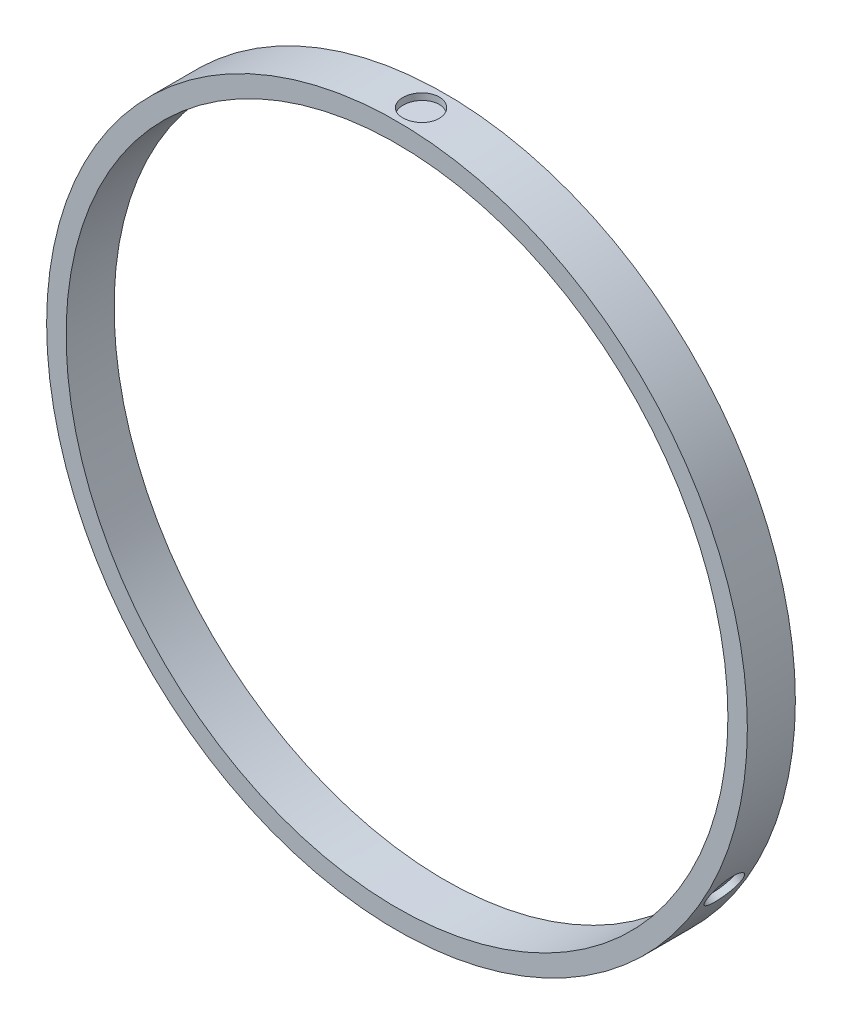
ISO-10303-21;
HEADER;
FILE_DESCRIPTION(('STEP AP214'),'2;1');
FILE_NAME('part.step','',(''),(''),'','','');
FILE_SCHEMA(('AUTOMOTIVE_DESIGN { 1 0 10303 214 1 1 1 1 }'));
ENDSEC;
DATA;
#1=APPLICATION_CONTEXT('core data for automotive mechanical design processes');
#2=APPLICATION_PROTOCOL_DEFINITION('international standard','automotive_design',2000,#1);
#3=PRODUCT_CONTEXT('',#1,'mechanical');
#4=PRODUCT('Part','Part','',(#3));
#5=PRODUCT_RELATED_PRODUCT_CATEGORY('part','',(#4));
#6=PRODUCT_DEFINITION_FORMATION('','',#4);
#7=PRODUCT_DEFINITION_CONTEXT('part definition',#1,'design');
#8=PRODUCT_DEFINITION('design','',#6,#7);
#9=PRODUCT_DEFINITION_SHAPE('','',#8);
#10=(LENGTH_UNIT() NAMED_UNIT(*) SI_UNIT(.MILLI.,.METRE.));
#11=(NAMED_UNIT(*) PLANE_ANGLE_UNIT() SI_UNIT($,.RADIAN.));
#12=(NAMED_UNIT(*) SI_UNIT($,.STERADIAN.) SOLID_ANGLE_UNIT());
#13=UNCERTAINTY_MEASURE_WITH_UNIT(LENGTH_MEASURE(1.E-05),#10,'distance_accuracy_value','');
#14=(GEOMETRIC_REPRESENTATION_CONTEXT(3) GLOBAL_UNCERTAINTY_ASSIGNED_CONTEXT((#13)) GLOBAL_UNIT_ASSIGNED_CONTEXT((#10,
#11,#12)) REPRESENTATION_CONTEXT('',''));
#15=CARTESIAN_POINT('',(0.,0.,0.));
#16=DIRECTION('',(0.,0.,1.));
#17=DIRECTION('',(1.,0.,0.));
#18=AXIS2_PLACEMENT_3D('',#15,#16,#17);
#19=CARTESIAN_POINT('',(0.,0.,3.7));
#20=DIRECTION('',(0.,0.,1.));
#21=DIRECTION('',(1.,0.,0.));
#22=AXIS2_PLACEMENT_3D('',#19,#20,#21);
#23=PLANE('',#22);
#24=CARTESIAN_POINT('',(0.,0.,3.7));
#25=DIRECTION('',(0.,0.,1.));
#26=DIRECTION('',(1.,0.,0.));
#27=AXIS2_PLACEMENT_3D('',#24,#25,#26);
#28=CIRCLE('',#27,27.);
#29=CARTESIAN_POINT('',(27.,0.,3.7));
#30=VERTEX_POINT('',#29);
#31=EDGE_CURVE('E12',#30,#30,#28,.T.);
#32=ORIENTED_EDGE('',*,*,#31,.T.);
#33=EDGE_LOOP('',(#32));
#34=FACE_BOUND('',#33,.T.);
#35=CARTESIAN_POINT('',(0.,0.,3.7));
#36=DIRECTION('',(0.,0.,1.));
#37=DIRECTION('',(1.,0.,0.));
#38=AXIS2_PLACEMENT_3D('',#35,#36,#37);
#39=CIRCLE('',#38,25.5);
#40=CARTESIAN_POINT('',(25.5,0.,3.7));
#41=VERTEX_POINT('',#40);
#42=EDGE_CURVE('E91',#41,#41,#39,.T.);
#43=ORIENTED_EDGE('',*,*,#42,.F.);
#44=EDGE_LOOP('',(#43));
#45=FACE_BOUND('',#44,.T.);
#46=ADVANCED_FACE('F74',(#34,#45),#23,.T.);
#47=CARTESIAN_POINT('',(0.,0.,0.));
#48=DIRECTION('',(0.,0.,1.));
#49=DIRECTION('',(1.,0.,0.));
#50=AXIS2_PLACEMENT_3D('',#47,#48,#49);
#51=PLANE('',#50);
#52=CARTESIAN_POINT('',(0.,0.,0.));
#53=DIRECTION('',(0.,0.,1.));
#54=DIRECTION('',(1.,0.,0.));
#55=AXIS2_PLACEMENT_3D('',#52,#53,#54);
#56=CIRCLE('',#55,27.);
#57=CARTESIAN_POINT('',(27.,0.,0.));
#58=VERTEX_POINT('',#57);
#59=EDGE_CURVE('E85',#58,#58,#56,.T.);
#60=ORIENTED_EDGE('',*,*,#59,.F.);
#61=EDGE_LOOP('',(#60));
#62=FACE_BOUND('',#61,.T.);
#63=CARTESIAN_POINT('',(0.,0.,0.));
#64=DIRECTION('',(0.,0.,1.));
#65=DIRECTION('',(1.,0.,0.));
#66=AXIS2_PLACEMENT_3D('',#63,#64,#65);
#67=CIRCLE('',#66,25.5);
#68=CARTESIAN_POINT('',(25.5,0.,0.));
#69=VERTEX_POINT('',#68);
#70=EDGE_CURVE('E94',#69,#69,#67,.T.);
#71=ORIENTED_EDGE('',*,*,#70,.T.);
#72=EDGE_LOOP('',(#71));
#73=FACE_BOUND('',#72,.T.);
#74=ADVANCED_FACE('F287',(#62,#73),#51,.F.);
#75=CARTESIAN_POINT('',(0.,0.,3.7));
#76=DIRECTION('',(0.,0.,-1.));
#77=DIRECTION('',(-1.,0.,0.));
#78=AXIS2_PLACEMENT_3D('',#75,#76,#77);
#79=CYLINDRICAL_SURFACE('',#78,27.);
#80=CARTESIAN_POINT('',(23.3826859021798,-13.5000000000001,3.25));
#81=CARTESIAN_POINT('',(23.3369720012245,-13.5791787990669,3.24937344690639));
#82=CARTESIAN_POINT('',(23.2914396787337,-13.6571144566661,3.23998236500854));
#83=CARTESIAN_POINT('',(23.2008034235033,-13.810527075189,3.20367114360438));
#84=CARTESIAN_POINT('',(23.156127438842,-13.8852955811861,3.17709143706411));
#85=CARTESIAN_POINT('',(23.0655551066218,-14.0352356219691,3.10504123451094));
#86=CARTESIAN_POINT('',(23.0228928523999,-14.1050411409995,3.06188130810979));
#87=CARTESIAN_POINT('',(22.9430886367693,-14.2344815391261,2.96129180505838));
#88=CARTESIAN_POINT('',(22.9062158411216,-14.2936873771667,2.90436945390259));
#89=CARTESIAN_POINT('',(22.8026106597129,-14.4588325630547,2.70915457209468));
#90=CARTESIAN_POINT('',(22.748127889455,-14.5439956427086,2.55688024296594));
#91=CARTESIAN_POINT('',(22.6706322381237,-14.6645001842502,2.21091710899371));
#92=CARTESIAN_POINT('',(22.6513114055626,-14.6941516377595,2.03283040754634));
#93=CARTESIAN_POINT('',(22.6522509934303,-14.6927031439376,1.66305745662011));
#94=CARTESIAN_POINT('',(22.672015064502,-14.6623596258568,1.48396744585318));
#95=CARTESIAN_POINT('',(22.7489345286666,-14.5427313353923,1.13955660968427));
#96=CARTESIAN_POINT('',(22.803274600342,-14.4578047439808,0.988928898976522));
#97=CARTESIAN_POINT('',(22.9436522455562,-14.2339830036664,0.727725219409592));
#98=CARTESIAN_POINT('',(23.0239389127961,-14.1041644033076,0.626492697821848));
#99=CARTESIAN_POINT('',(23.2006644626435,-13.8115308734234,0.484624282406837));
#100=CARTESIAN_POINT('',(23.2915310916219,-13.6579423103953,0.449721652416454));
#101=CARTESIAN_POINT('',(23.4314215514045,-13.4155576204233,0.451420604388701));
#102=CARTESIAN_POINT('',(23.4766565177954,-13.3362133750768,0.46070585675003));
#103=CARTESIAN_POINT('',(23.5644347464117,-13.1804932958606,0.496714231547181));
#104=CARTESIAN_POINT('',(23.607244241811,-13.1036342491132,0.523666124325889));
#105=CARTESIAN_POINT('',(23.7301809925887,-12.8805029003992,0.629305985716438));
#106=CARTESIAN_POINT('',(23.8016640443603,-12.7474742046384,0.731418598906432));
#107=CARTESIAN_POINT('',(23.9247639125852,-12.514910371456,0.997760765707094));
#108=CARTESIAN_POINT('',(23.9713363197556,-12.4249717376438,1.15044874741855));
#109=CARTESIAN_POINT('',(24.0353589021191,-12.3006670584325,1.48961867614057));
#110=CARTESIAN_POINT('',(24.0509924798842,-12.26987210358,1.66851422265784));
#111=CARTESIAN_POINT('',(24.0502289456034,-12.2713686428904,2.04484536311613));
#112=CARTESIAN_POINT('',(24.0336734410934,-12.3039672038302,2.22427856309461));
#113=CARTESIAN_POINT('',(23.9847609190559,-12.398891509415,2.47646007255914));
#114=CARTESIAN_POINT('',(23.9647598671101,-12.4375614334783,2.55613970349952));
#115=CARTESIAN_POINT('',(23.9171598501413,-12.5288512882303,2.70673722095136));
#116=CARTESIAN_POINT('',(23.8893081841295,-12.5819481540011,2.77818818439507));
#117=CARTESIAN_POINT('',(23.8267402784595,-12.7000359278674,2.91019605912456));
#118=CARTESIAN_POINT('',(23.7932155149911,-12.762781419633,2.96840389590292));
#119=CARTESIAN_POINT('',(23.7215058116218,-12.8955750603583,3.06922736828688));
#120=CARTESIAN_POINT('',(23.6836174484507,-12.9650854555124,3.11158872730295));
#121=CARTESIAN_POINT('',(23.5608844633287,-13.1876240679992,3.2168101621292));
#122=CARTESIAN_POINT('',(23.4741137040904,-13.3416424018666,3.25125310618723));
#123=CARTESIAN_POINT('',(23.3826859021798,-13.5000000000001,3.25));
#124=B_SPLINE_CURVE_WITH_KNOTS('',3,(#80,#81,#82,#83,#84,#85,#86,#87,#88,#89,#90,#91,#92,#93,
#94,#95,#96,#97,#98,#99,#100,#101,#102,#103,#104,#105,#106,#107,#108,#109,#110,#111,#112,#113,
#114,#115,#116,#117,#118,#119,#120,#121,#122,#123),.UNSPECIFIED.,.T.,.F.,(4,2,2,2,2,2,2,2,2,2,2,
2,2,2,2,2,2,2,2,2,2,4),(0.,0.03125,0.0625,0.09375,0.125,0.1875,0.25,0.3125,0.375,0.4375,0.5,
0.53125,0.5625,0.625,0.6875,0.75,0.8125,0.84375,0.875,0.90625,0.9375,1.),.UNSPECIFIED.);
#125=CARTESIAN_POINT('',(23.3826859021798,-13.5000000000001,3.25));
#126=VERTEX_POINT('',#125);
#127=EDGE_CURVE('E125',#126,#126,#124,.T.);
#128=ORIENTED_EDGE('',*,*,#127,.F.);
#129=EDGE_LOOP('',(#128));
#130=FACE_BOUND('',#129,.T.);
#131=CARTESIAN_POINT('',(-23.38268590218,-13.4999999999998,3.25));
#132=CARTESIAN_POINT('',(-23.4283998031465,-13.4208212009136,3.24937344690623));
#133=CARTESIAN_POINT('',(-23.4731279012481,-13.342421224134,3.23998236500831));
#134=CARTESIAN_POINT('',(-23.5606689985346,-13.1872216153389,3.20367114360415));
#135=CARTESIAN_POINT('',(-23.6030824317669,-13.111146824745,3.1770914370878));
#136=CARTESIAN_POINT('',(-23.6876481500536,-12.9577388637087,3.10504123448725));
#137=CARTESIAN_POINT('',(-23.7267703757556,-12.885889508239,3.06188130807425));
#138=CARTESIAN_POINT('',(-23.7989669409936,-12.7520568311104,2.96129180502284));
#139=CARTESIAN_POINT('',(-23.8318043029266,-12.690521134423,2.9043694539435));
#140=CARTESIAN_POINT('',(-23.9230216385547,-12.5182238223385,2.70915457201284));
#141=CARTESIAN_POINT('',(-23.9695336438425,-12.4284588194526,2.55688024302857));
#142=CARTESIAN_POINT('',(-24.035145812425,-12.3010933459427,2.21091710893106));
#143=CARTESIAN_POINT('',(-24.0511643081427,-12.2695352873678,2.03283040749282));
#144=CARTESIAN_POINT('',(-24.0503796696278,-12.2710732412448,1.66305745667362));
#145=CARTESIAN_POINT('',(-24.0339834476478,-12.3033611879497,1.48396744581311));
#146=CARTESIAN_POINT('',(-23.9688420412137,-12.429789543122,1.13955660972433));
#147=CARTESIAN_POINT('',(-23.9224634914224,-12.5193127213615,0.988928898995113));
#148=CARTESIAN_POINT('',(-23.7988170009804,-12.7527941984308,0.727725219390992));
#149=CARTESIAN_POINT('',(-23.726534128827,-12.8872337919862,0.626492697821688));
#150=CARTESIAN_POINT('',(-23.5614688328472,-13.1865993726386,0.484624282406992));
#151=CARTESIAN_POINT('',(-23.4738905500478,-13.3420864631609,0.449721652416308));
#152=CARTESIAN_POINT('',(-23.3339244809167,-13.5844275000971,0.451420604388775));
#153=CARTESIAN_POINT('',(-23.2878278319949,-13.6632742528094,0.460705856750141));
#154=CARTESIAN_POINT('',(-23.1968594018224,-13.8171524682984,0.496714231547292));
#155=CARTESIAN_POINT('',(-23.1517022625312,-13.8926561022059,0.523666124326042));
#156=CARTESIAN_POINT('',(-23.0199332215719,-14.1106881257638,0.629305985716141));
#157=CARTESIAN_POINT('',(-22.9404685174964,-14.2391086124195,0.731418598907004));
#158=CARTESIAN_POINT('',(-22.8006122640464,-14.4619981421358,0.997760765706518));
#159=CARTESIAN_POINT('',(-22.7460093259786,-14.5473003467508,1.15044874737238));
#160=CARTESIAN_POINT('',(-22.6703696071591,-14.6648978690913,1.48961867618673));
#161=CARTESIAN_POINT('',(-22.6515171828307,-14.6938344220146,1.66851422261282));
#162=CARTESIAN_POINT('',(-22.6524314567464,-14.6924249122826,2.04484536316112));
#163=CARTESIAN_POINT('',(-22.6723848863535,-14.6617881443944,2.22427856297113));
#164=CARTESIAN_POINT('',(-22.730135485469,-14.5719665048592,2.47646007262087));
#165=CARTESIAN_POINT('',(-22.7536240961074,-14.5353101237242,2.55613970359212));
#166=CARTESIAN_POINT('',(-22.8088834209458,-14.4484423724325,2.70673722104396));
#167=CARTESIAN_POINT('',(-22.8409408225007,-14.3977736893353,2.77818818436761));
#168=CARTESIAN_POINT('',(-22.9119238817659,-14.2845444065417,2.91019605915201));
#169=CARTESIAN_POINT('',(-22.9495006898872,-14.2241383638169,2.9684038959441));
#170=CARTESIAN_POINT('',(-23.0286485045313,-14.0956391186385,3.06922736832806));
#171=CARTESIAN_POINT('',(-23.0699020909281,-14.0280716361262,3.11158872730304));
#172=CARTESIAN_POINT('',(-23.2012596901251,-13.8105124468494,3.21681016212901));
#173=CARTESIAN_POINT('',(-23.291258100247,-13.658357598172,3.25125310618753));
#174=CARTESIAN_POINT('',(-23.38268590218,-13.4999999999998,3.25));
#175=B_SPLINE_CURVE_WITH_KNOTS('',3,(#131,#132,#133,#134,#135,#136,#137,#138,#139,#140,#141,
#142,#143,#144,#145,#146,#147,#148,#149,#150,#151,#152,#153,#154,#155,#156,#157,#158,#159,#160,
#161,#162,#163,#164,#165,#166,#167,#168,#169,#170,#171,#172,#173,#174),.UNSPECIFIED.,.T.,.F.,(4,
2,2,2,2,2,2,2,2,2,2,2,2,2,2,2,2,2,2,2,2,4),(0.,0.03125,0.0625,0.09375,0.125,0.1875,0.25,0.3125,
0.375,0.4375,0.5,0.53125,0.5625,0.625,0.6875,0.75,0.8125,0.84375,0.875,0.90625,0.9375,1.),.UNSPECIFIED.);
#176=CARTESIAN_POINT('',(-23.38268590218,-13.4999999999998,3.25));
#177=VERTEX_POINT('',#176);
#178=EDGE_CURVE('E114',#177,#177,#175,.T.);
#179=ORIENTED_EDGE('',*,*,#178,.F.);
#180=EDGE_LOOP('',(#179));
#181=FACE_BOUND('',#180,.T.);
#182=CARTESIAN_POINT('',(0.,27.,3.25));
#183=CARTESIAN_POINT('',(0.0914278019167564,27.,3.24937344690635));
#184=CARTESIAN_POINT('',(0.181688222506761,26.9995356808293,3.23998236500848));
#185=CARTESIAN_POINT('',(0.359865575023892,26.9977486905572,3.20367114360432));
#186=CARTESIAN_POINT('',(0.44695499293898,26.9964424059002,3.17709143706777));
#187=CARTESIAN_POINT('',(0.62209304341731,26.9929744857089,3.10504123450729));
#188=CARTESIAN_POINT('',(0.703877523334323,26.9909306492851,3.06188130810432));
#189=CARTESIAN_POINT('',(0.855878304203178,26.9865383702832,2.96129180505291));
#190=CARTESIAN_POINT('',(0.925588461808687,26.9842085115646,2.90436945391147));
#191=CARTESIAN_POINT('',(1.12041097883384,26.9770563854439,2.70915457207696));
#192=CARTESIAN_POINT('',(1.22140575438727,26.9724544621597,2.55688024299727));
#193=CARTESIAN_POINT('',(1.36451357430127,26.9655935301946,2.2109171089624));
#194=CARTESIAN_POINT('',(1.39985290258011,26.9636869251291,2.03283040754815));
#195=CARTESIAN_POINT('',(1.39812867619706,26.9637763851808,1.66305745661834));
#196=CARTESIAN_POINT('',(1.36196838317177,26.9657208137703,1.4839674458725));
#197=CARTESIAN_POINT('',(1.21990751252067,26.9725208785508,1.139556609665));
#198=CARTESIAN_POINT('',(1.11918889109353,26.9771174653582,0.988928898986592));
#199=CARTESIAN_POINT('',(0.855164755410736,26.9867772020815,0.727725219399555));
#200=CARTESIAN_POINT('',(0.702595216018423,26.9913981953163,0.626492697820993));
#201=CARTESIAN_POINT('',(0.360804370215867,26.9981302460398,0.484624282407709));
#202=CARTESIAN_POINT('',(0.182359458399401,27.0000287735773,0.449721652417411));
#203=CARTESIAN_POINT('',(-0.0974970704747251,26.9999851205101,0.451420604388226));
#204=CARTESIAN_POINT('',(-0.188828685780792,26.9994876278708,0.460705856749317));
#205=CARTESIAN_POINT('',(-0.367575344569506,26.9976457641437,0.496714231546467));
#206=CARTESIAN_POINT('',(-0.455541979288021,26.9962903513086,0.523666124334282));
#207=CARTESIAN_POINT('',(-0.710247771000939,26.9911910261846,0.629305985699656));
#208=CARTESIAN_POINT('',(-0.861195526864838,26.9865828170783,0.731418598906702));
#209=CARTESIAN_POINT('',(-1.12415164853827,26.9769085135715,0.99776076570681));
#210=CARTESIAN_POINT('',(-1.22532699377485,26.9722720843908,1.15044874739017));
#211=CARTESIAN_POINT('',(-1.36498929496256,26.9655649275278,1.48961867616892));
#212=CARTESIAN_POINT('',(-1.39947529705608,26.9637065255981,1.66851422262961));
#213=CARTESIAN_POINT('',(-1.3977974888548,26.9637935551696,2.04484536314432));
#214=CARTESIAN_POINT('',(-1.36128855472755,26.96575534816,2.22427856305548));
#215=CARTESIAN_POINT('',(-1.25462543359336,26.9708580143067,2.47646007257869));
#216=CARTESIAN_POINT('',(-1.21113577101218,26.9728715572513,2.55613970352885));
#217=CARTESIAN_POINT('',(-1.10827642920471,26.9772936607116,2.70673722098069));
#218=CARTESIAN_POINT('',(-1.04836736160805,26.979721843292,2.77818818439382));
#219=CARTESIAN_POINT('',(-0.914816396714813,26.9845803344538,2.91019605912578));
#220=CARTESIAN_POINT('',(-0.843714825135209,26.9869197835172,2.96840389590476));
#221=CARTESIAN_POINT('',(-0.692857307121486,26.9912141790641,3.06922736828873));
#222=CARTESIAN_POINT('',(-0.613715357511846,26.993157091627,3.1115887273029));
#223=CARTESIAN_POINT('',(-0.359624773225727,26.9981365148721,3.21681016212924));
#224=CARTESIAN_POINT('',(-0.182855603833536,27.,3.25125310618731));
#225=CARTESIAN_POINT('',(0.,27.,3.25));
#226=B_SPLINE_CURVE_WITH_KNOTS('',3,(#182,#183,#184,#185,#186,#187,#188,#189,#190,#191,#192,
#193,#194,#195,#196,#197,#198,#199,#200,#201,#202,#203,#204,#205,#206,#207,#208,#209,#210,#211,
#212,#213,#214,#215,#216,#217,#218,#219,#220,#221,#222,#223,#224,#225),.UNSPECIFIED.,.T.,.F.,(4,
2,2,2,2,2,2,2,2,2,2,2,2,2,2,2,2,2,2,2,2,4),(0.,0.03125,0.0625,0.09375,0.125,0.1875,0.25,0.3125,
0.375,0.4375,0.5,0.53125,0.5625,0.625,0.6875,0.75,0.8125,0.84375,0.875,0.90625,0.9375,1.),.UNSPECIFIED.);
#227=CARTESIAN_POINT('',(0.,27.,3.25));
#228=VERTEX_POINT('',#227);
#229=EDGE_CURVE('E101',#228,#228,#226,.T.);
#230=ORIENTED_EDGE('',*,*,#229,.F.);
#231=EDGE_LOOP('',(#230));
#232=FACE_BOUND('',#231,.T.);
#233=ORIENTED_EDGE('',*,*,#31,.F.);
#234=EDGE_LOOP('',(#233));
#235=FACE_BOUND('',#234,.T.);
#236=ORIENTED_EDGE('',*,*,#59,.T.);
#237=EDGE_LOOP('',(#236));
#238=FACE_BOUND('',#237,.T.);
#239=ADVANCED_FACE('F76',(#130,#181,#232,#235,#238),#79,.T.);
#240=CARTESIAN_POINT('',(0.,0.,3.7));
#241=DIRECTION('',(0.,0.,-1.));
#242=DIRECTION('',(-1.,0.,0.));
#243=AXIS2_PLACEMENT_3D('',#240,#241,#242);
#244=CYLINDRICAL_SURFACE('',#243,25.5);
#245=ORIENTED_EDGE('',*,*,#42,.T.);
#246=EDGE_LOOP('',(#245));
#247=FACE_BOUND('',#246,.T.);
#248=ORIENTED_EDGE('',*,*,#70,.F.);
#249=EDGE_LOOP('',(#248));
#250=FACE_BOUND('',#249,.T.);
#251=ADVANCED_FACE('F255',(#247,#250),#244,.F.);
#252=CARTESIAN_POINT('',(0.,27.,3.25));
#253=CARTESIAN_POINT('',(0.0914278019167564,27.,3.24937344690635));
#254=CARTESIAN_POINT('',(0.181688222506761,26.9995356808293,3.23998236500848));
#255=CARTESIAN_POINT('',(0.359865575023892,26.9977486905572,3.20367114360432));
#256=CARTESIAN_POINT('',(0.44695499293898,26.9964424059002,3.17709143706777));
#257=CARTESIAN_POINT('',(0.62209304341731,26.9929744857089,3.10504123450729));
#258=CARTESIAN_POINT('',(0.703877523334323,26.9909306492851,3.06188130810432));
#259=CARTESIAN_POINT('',(0.855878304203178,26.9865383702832,2.96129180505291));
#260=CARTESIAN_POINT('',(0.925588461808687,26.9842085115646,2.90436945391147));
#261=CARTESIAN_POINT('',(1.12041097883384,26.9770563854439,2.70915457207696));
#262=CARTESIAN_POINT('',(1.22140575438727,26.9724544621597,2.55688024299727));
#263=CARTESIAN_POINT('',(1.36451357430127,26.9655935301946,2.2109171089624));
#264=CARTESIAN_POINT('',(1.39985290258011,26.9636869251291,2.03283040754815));
#265=CARTESIAN_POINT('',(1.39812867619706,26.9637763851808,1.66305745661834));
#266=CARTESIAN_POINT('',(1.36196838317177,26.9657208137703,1.4839674458725));
#267=CARTESIAN_POINT('',(1.21990751252067,26.9725208785508,1.139556609665));
#268=CARTESIAN_POINT('',(1.11918889109353,26.9771174653582,0.988928898986592));
#269=CARTESIAN_POINT('',(0.855164755410736,26.9867772020815,0.727725219399555));
#270=CARTESIAN_POINT('',(0.702595216018423,26.9913981953163,0.626492697820993));
#271=CARTESIAN_POINT('',(0.360804370215867,26.9981302460398,0.484624282407709));
#272=CARTESIAN_POINT('',(0.182359458399401,27.0000287735773,0.449721652417411));
#273=CARTESIAN_POINT('',(-0.0974970704747251,26.9999851205101,0.451420604388226));
#274=CARTESIAN_POINT('',(-0.188828685780792,26.9994876278708,0.460705856749317));
#275=CARTESIAN_POINT('',(-0.367575344569506,26.9976457641437,0.496714231546467));
#276=CARTESIAN_POINT('',(-0.455541979288021,26.9962903513086,0.523666124334282));
#277=CARTESIAN_POINT('',(-0.710247771000939,26.9911910261846,0.629305985699656));
#278=CARTESIAN_POINT('',(-0.861195526864838,26.9865828170783,0.731418598906702));
#279=CARTESIAN_POINT('',(-1.12415164853827,26.9769085135715,0.99776076570681));
#280=CARTESIAN_POINT('',(-1.22532699377485,26.9722720843908,1.15044874739017));
#281=CARTESIAN_POINT('',(-1.36498929496256,26.9655649275278,1.48961867616892));
#282=CARTESIAN_POINT('',(-1.39947529705608,26.9637065255981,1.66851422262961));
#283=CARTESIAN_POINT('',(-1.3977974888548,26.9637935551696,2.04484536314432));
#284=CARTESIAN_POINT('',(-1.36128855472755,26.96575534816,2.22427856305548));
#285=CARTESIAN_POINT('',(-1.25462543359336,26.9708580143067,2.47646007257869));
#286=CARTESIAN_POINT('',(-1.21113577101218,26.9728715572513,2.55613970352885));
#287=CARTESIAN_POINT('',(-1.10827642920471,26.9772936607116,2.70673722098069));
#288=CARTESIAN_POINT('',(-1.04836736160805,26.979721843292,2.77818818439382));
#289=CARTESIAN_POINT('',(-0.914816396714813,26.9845803344538,2.91019605912578));
#290=CARTESIAN_POINT('',(-0.843714825135209,26.9869197835172,2.96840389590476));
#291=CARTESIAN_POINT('',(-0.692857307121486,26.9912141790641,3.06922736828873));
#292=CARTESIAN_POINT('',(-0.613715357511846,26.993157091627,3.1115887273029));
#293=CARTESIAN_POINT('',(-0.359624773225727,26.9981365148721,3.21681016212924));
#294=CARTESIAN_POINT('',(-0.182855603833536,27.,3.25125310618731));
#295=CARTESIAN_POINT('',(0.,27.,3.25));
#296=CARTESIAN_POINT('',(0.,26.5,3.25));
#297=CARTESIAN_POINT('',(0.0897346944738535,26.5,3.24937344690635));
#298=CARTESIAN_POINT('',(0.178323625793673,26.4995442793324,3.23998236500848));
#299=CARTESIAN_POINT('',(0.353201397708634,26.4977903814728,3.20367114360432));
#300=CARTESIAN_POINT('',(0.438678048625295,26.4965082872724,3.17709143706777));
#301=CARTESIAN_POINT('',(0.610572801872545,26.4931045878254,3.10504123450729));
#302=CARTESIAN_POINT('',(0.690842754383687,26.4910986002243,3.06188130810432));
#303=CARTESIAN_POINT('',(0.840028705977193,26.4867876597224,2.96129180505291));
#304=CARTESIAN_POINT('',(0.908447934738156,26.4845009465356,2.90436945391147));
#305=CARTESIAN_POINT('',(1.09966262737395,26.4774812671949,2.70915457207696));
#306=CARTESIAN_POINT('',(1.19878712930602,26.4729645647123,2.55688024299727));
#307=CARTESIAN_POINT('',(1.3392448044068,26.4662306870429,2.2109171089624));
#308=CARTESIAN_POINT('',(1.37392970068048,26.4643593894786,2.03283040754815));
#309=CARTESIAN_POINT('',(1.37223740441563,26.4644471928627,1.66305745661834));
#310=CARTESIAN_POINT('',(1.33674674644637,26.4663556135153,1.4839674458725));
#311=CARTESIAN_POINT('',(1.19731663265917,26.4730297511702,1.139556609665));
#312=CARTESIAN_POINT('',(1.09846317088809,26.4775412159998,0.988928898986592));
#313=CARTESIAN_POINT('',(0.839328371051278,26.4870220687096,0.727725219399555));
#314=CARTESIAN_POINT('',(0.689584193499564,26.4915574879956,0.626492697820993));
#315=CARTESIAN_POINT('',(0.354122807804462,26.4981648711131,0.484624282407709));
#316=CARTESIAN_POINT('',(0.178982431392005,26.5000282407333,0.449721652417411));
#317=CARTESIAN_POINT('',(-0.0956915691696376,26.4999853960562,0.451420604388226));
#318=CARTESIAN_POINT('',(-0.185331858266333,26.4994971162436,0.460705856749317));
#319=CARTESIAN_POINT('',(-0.360768393744145,26.497689361104,0.496714231546467));
#320=CARTESIAN_POINT('',(-0.447106016708614,26.4963590485066,0.523666124334282));
#321=CARTESIAN_POINT('',(-0.697095034500921,26.4913541553293,0.629305985699656));
#322=CARTESIAN_POINT('',(-0.845247461552526,26.4868312834287,0.731418598906702));
#323=CARTESIAN_POINT('',(-1.10333402541719,26.4773361336906,0.99776076570681));
#324=CARTESIAN_POINT('',(-1.20263575314939,26.4727855643095,1.15044874739017));
#325=CARTESIAN_POINT('',(-1.33971171542622,26.4662026140551,1.48961867616892));
#326=CARTESIAN_POINT('',(-1.37355908785134,26.4643786269759,1.66851422262961));
#327=CARTESIAN_POINT('',(-1.37191235017231,26.4644640448887,2.04484536314432));
#328=CARTESIAN_POINT('',(-1.33607950741778,26.4663895083792,2.22427856305548));
#329=CARTESIAN_POINT('',(-1.23139162926756,26.4713976807085,2.47646007257869));
#330=CARTESIAN_POINT('',(-1.18870733080825,26.4733739358207,2.55613970352885));
#331=CARTESIAN_POINT('',(-1.08775279162685,26.4777141484762,2.70673722098069));
#332=CARTESIAN_POINT('',(-1.0289531512079,26.4800973647125,2.77818818439382));
#333=CARTESIAN_POINT('',(-0.897875352331206,26.4848658838158,2.91019605912578));
#334=CARTESIAN_POINT('',(-0.828090476521594,26.4871620097483,2.96840389590476));
#335=CARTESIAN_POINT('',(-0.680026616248866,26.4913768794518,3.06922736828873));
#336=CARTESIAN_POINT('',(-0.602350258298664,26.4932838121524,3.1115887273029));
#337=CARTESIAN_POINT('',(-0.352965055203028,26.498171023856,3.21681016212924));
#338=CARTESIAN_POINT('',(-0.179469388947729,26.5,3.25125310618731));
#339=CARTESIAN_POINT('',(0.,26.5,3.25));
#340=B_SPLINE_SURFACE_WITH_KNOTS('',1,3,((#252,#253,#254,#255,#256,#257,#258,#259,#260,#261,
#262,#263,#264,#265,#266,#267,#268,#269,#270,#271,#272,#273,#274,#275,#276,#277,#278,#279,#280,
#281,#282,#283,#284,#285,#286,#287,#288,#289,#290,#291,#292,#293,#294,#295),(#296,#297,#298,
#299,#300,#301,#302,#303,#304,#305,#306,#307,#308,#309,#310,#311,#312,#313,#314,#315,#316,#317,
#318,#319,#320,#321,#322,#323,#324,#325,#326,#327,#328,#329,#330,#331,#332,#333,#334,#335,#336,
#337,#338,#339)),.UNSPECIFIED.,.F.,.T.,.F.,(2,2),(4,2,2,2,2,2,2,2,2,2,2,2,2,2,2,2,2,2,2,2,2,4),
(0.,1.),(0.,0.03125,0.0625,0.09375,0.125,0.1875,0.25,0.3125,0.375,0.4375,0.5,0.53125,0.5625,
0.625,0.6875,0.75,0.8125,0.84375,0.875,0.90625,0.9375,1.),.UNSPECIFIED.);
#341=CARTESIAN_POINT('',(0.,26.5,3.25));
#342=CARTESIAN_POINT('',(-0.179469388947729,26.5,3.25125310618731));
#343=CARTESIAN_POINT('',(-0.352965055203028,26.498171023856,3.21681016212924));
#344=CARTESIAN_POINT('',(-0.602350258298664,26.4932838121524,3.1115887273029));
#345=CARTESIAN_POINT('',(-0.680026616248866,26.4913768794518,3.06922736828873));
#346=CARTESIAN_POINT('',(-0.828090476521594,26.4871620097483,2.96840389590476));
#347=CARTESIAN_POINT('',(-0.897875352331206,26.4848658838158,2.91019605912578));
#348=CARTESIAN_POINT('',(-1.0289531512079,26.4800973647125,2.77818818439382));
#349=CARTESIAN_POINT('',(-1.08775279162685,26.4777141484762,2.70673722098069));
#350=CARTESIAN_POINT('',(-1.18870733080825,26.4733739358207,2.55613970352885));
#351=CARTESIAN_POINT('',(-1.23139162926756,26.4713976807085,2.47646007257869));
#352=CARTESIAN_POINT('',(-1.33607950741778,26.4663895083792,2.22427856305548));
#353=CARTESIAN_POINT('',(-1.37191235017231,26.4644640448887,2.04484536314432));
#354=CARTESIAN_POINT('',(-1.37355908785134,26.4643786269759,1.66851422262961));
#355=CARTESIAN_POINT('',(-1.33971171542622,26.4662026140551,1.48961867616892));
#356=CARTESIAN_POINT('',(-1.20263575314939,26.4727855643095,1.15044874739017));
#357=CARTESIAN_POINT('',(-1.10333402541719,26.4773361336906,0.99776076570681));
#358=CARTESIAN_POINT('',(-0.845247461552526,26.4868312834287,0.731418598906702));
#359=CARTESIAN_POINT('',(-0.697095034500921,26.4913541553293,0.629305985699656));
#360=CARTESIAN_POINT('',(-0.447106016708614,26.4963590485066,0.523666124334282));
#361=CARTESIAN_POINT('',(-0.360768393744145,26.497689361104,0.496714231546467));
#362=CARTESIAN_POINT('',(-0.185331858266333,26.4994971162436,0.460705856749317));
#363=CARTESIAN_POINT('',(-0.0956915691696376,26.4999853960562,0.451420604388226));
#364=CARTESIAN_POINT('',(0.178982431392005,26.5000282407333,0.449721652417411));
#365=CARTESIAN_POINT('',(0.354122807804462,26.4981648711131,0.484624282407709));
#366=CARTESIAN_POINT('',(0.689584193499564,26.4915574879956,0.626492697820993));
#367=CARTESIAN_POINT('',(0.839328371051278,26.4870220687096,0.727725219399555));
#368=CARTESIAN_POINT('',(1.09846317088809,26.4775412159998,0.988928898986592));
#369=CARTESIAN_POINT('',(1.19731663265917,26.4730297511702,1.139556609665));
#370=CARTESIAN_POINT('',(1.33674674644637,26.4663556135153,1.4839674458725));
#371=CARTESIAN_POINT('',(1.37223740441563,26.4644471928627,1.66305745661834));
#372=CARTESIAN_POINT('',(1.37392970068048,26.4643593894786,2.03283040754815));
#373=CARTESIAN_POINT('',(1.3392448044068,26.4662306870429,2.2109171089624));
#374=CARTESIAN_POINT('',(1.19878712930602,26.4729645647123,2.55688024299727));
#375=CARTESIAN_POINT('',(1.09966262737395,26.4774812671949,2.70915457207696));
#376=CARTESIAN_POINT('',(0.908447934738156,26.4845009465356,2.90436945391147));
#377=CARTESIAN_POINT('',(0.840028705977193,26.4867876597224,2.96129180505291));
#378=CARTESIAN_POINT('',(0.690842754383687,26.4910986002243,3.06188130810432));
#379=CARTESIAN_POINT('',(0.610572801872545,26.4931045878254,3.10504123450729));
#380=CARTESIAN_POINT('',(0.438678048625295,26.4965082872724,3.17709143706777));
#381=CARTESIAN_POINT('',(0.353201397708634,26.4977903814728,3.20367114360432));
#382=CARTESIAN_POINT('',(0.178323625793673,26.4995442793324,3.23998236500848));
#383=CARTESIAN_POINT('',(0.0897346944738535,26.5,3.24937344690635));
#384=CARTESIAN_POINT('',(0.,26.5,3.25));
#385=B_SPLINE_CURVE_WITH_KNOTS('',3,(#341,#342,#343,#344,#345,#346,#347,#348,#349,#350,#351,
#352,#353,#354,#355,#356,#357,#358,#359,#360,#361,#362,#363,#364,#365,#366,#367,#368,#369,#370,
#371,#372,#373,#374,#375,#376,#377,#378,#379,#380,#381,#382,#383,#384),.UNSPECIFIED.,.T.,.F.,(4,
2,2,2,2,2,2,2,2,2,2,2,2,2,2,2,2,2,2,2,2,4),(0.,0.0625,0.09375,0.125,0.15625,0.1875,0.25,0.3125,
0.375,0.4375,0.46875,0.5,0.5625,0.625,0.6875,0.75,0.8125,0.875,0.90625,0.9375,0.96875,1.),.UNSPECIFIED.);
#386=CARTESIAN_POINT('',(0.,26.5,3.25));
#387=VERTEX_POINT('',#386);
#388=EDGE_CURVE('E229',#387,#387,#385,.F.);
#389=ORIENTED_EDGE('',*,*,#229,.T.);
#390=EDGE_LOOP('',(#389));
#391=FACE_BOUND('',#390,.T.);
#392=ORIENTED_EDGE('',*,*,#388,.F.);
#393=EDGE_LOOP('',(#392));
#394=FACE_BOUND('',#393,.T.);
#395=ADVANCED_FACE('F244',(#391,#394),#340,.F.);
#396=CARTESIAN_POINT('',(0.,0.,3.7));
#397=DIRECTION('',(0.,0.,-1.));
#398=DIRECTION('',(-1.,0.,0.));
#399=AXIS2_PLACEMENT_3D('',#396,#397,#398);
#400=CYLINDRICAL_SURFACE('',#399,26.5);
#401=ORIENTED_EDGE('',*,*,#388,.T.);
#402=EDGE_LOOP('',(#401));
#403=FACE_BOUND('',#402,.T.);
#404=ADVANCED_FACE('F208',(#403),#400,.T.);
#405=CARTESIAN_POINT('',(-23.38268590218,-13.4999999999998,3.25));
#406=CARTESIAN_POINT('',(-23.4283998031465,-13.4208212009136,3.24937344690623));
#407=CARTESIAN_POINT('',(-23.4731279012481,-13.342421224134,3.23998236500831));
#408=CARTESIAN_POINT('',(-23.5606689985346,-13.1872216153389,3.20367114360415));
#409=CARTESIAN_POINT('',(-23.6030824317669,-13.111146824745,3.1770914370878));
#410=CARTESIAN_POINT('',(-23.6876481500536,-12.9577388637087,3.10504123448725));
#411=CARTESIAN_POINT('',(-23.7267703757556,-12.885889508239,3.06188130807425));
#412=CARTESIAN_POINT('',(-23.7989669409936,-12.7520568311104,2.96129180502284));
#413=CARTESIAN_POINT('',(-23.8318043029266,-12.690521134423,2.9043694539435));
#414=CARTESIAN_POINT('',(-23.9230216385547,-12.5182238223385,2.70915457201284));
#415=CARTESIAN_POINT('',(-23.9695336438425,-12.4284588194526,2.55688024302857));
#416=CARTESIAN_POINT('',(-24.035145812425,-12.3010933459427,2.21091710893106));
#417=CARTESIAN_POINT('',(-24.0511643081427,-12.2695352873678,2.03283040749282));
#418=CARTESIAN_POINT('',(-24.0503796696278,-12.2710732412448,1.66305745667362));
#419=CARTESIAN_POINT('',(-24.0339834476478,-12.3033611879497,1.48396744581311));
#420=CARTESIAN_POINT('',(-23.9688420412137,-12.429789543122,1.13955660972433));
#421=CARTESIAN_POINT('',(-23.9224634914224,-12.5193127213615,0.988928898995113));
#422=CARTESIAN_POINT('',(-23.7988170009804,-12.7527941984308,0.727725219390992));
#423=CARTESIAN_POINT('',(-23.726534128827,-12.8872337919862,0.626492697821688));
#424=CARTESIAN_POINT('',(-23.5614688328472,-13.1865993726386,0.484624282406992));
#425=CARTESIAN_POINT('',(-23.4738905500478,-13.3420864631609,0.449721652416308));
#426=CARTESIAN_POINT('',(-23.3339244809167,-13.5844275000971,0.451420604388775));
#427=CARTESIAN_POINT('',(-23.2878278319949,-13.6632742528094,0.460705856750141));
#428=CARTESIAN_POINT('',(-23.1968594018224,-13.8171524682984,0.496714231547292));
#429=CARTESIAN_POINT('',(-23.1517022625312,-13.8926561022059,0.523666124326042));
#430=CARTESIAN_POINT('',(-23.0199332215719,-14.1106881257638,0.629305985716141));
#431=CARTESIAN_POINT('',(-22.9404685174964,-14.2391086124195,0.731418598907004));
#432=CARTESIAN_POINT('',(-22.8006122640464,-14.4619981421358,0.997760765706518));
#433=CARTESIAN_POINT('',(-22.7460093259786,-14.5473003467508,1.15044874737238));
#434=CARTESIAN_POINT('',(-22.6703696071591,-14.6648978690913,1.48961867618673));
#435=CARTESIAN_POINT('',(-22.6515171828307,-14.6938344220146,1.66851422261282));
#436=CARTESIAN_POINT('',(-22.6524314567464,-14.6924249122826,2.04484536316112));
#437=CARTESIAN_POINT('',(-22.6723848863535,-14.6617881443944,2.22427856297113));
#438=CARTESIAN_POINT('',(-22.730135485469,-14.5719665048592,2.47646007262087));
#439=CARTESIAN_POINT('',(-22.7536240961074,-14.5353101237242,2.55613970359212));
#440=CARTESIAN_POINT('',(-22.8088834209458,-14.4484423724325,2.70673722104396));
#441=CARTESIAN_POINT('',(-22.8409408225007,-14.3977736893353,2.77818818436761));
#442=CARTESIAN_POINT('',(-22.9119238817659,-14.2845444065417,2.91019605915201));
#443=CARTESIAN_POINT('',(-22.9495006898872,-14.2241383638169,2.9684038959441));
#444=CARTESIAN_POINT('',(-23.0286485045313,-14.0956391186385,3.06922736832806));
#445=CARTESIAN_POINT('',(-23.0699020909281,-14.0280716361262,3.11158872730304));
#446=CARTESIAN_POINT('',(-23.2012596901251,-13.8105124468494,3.21681016212901));
#447=CARTESIAN_POINT('',(-23.291258100247,-13.658357598172,3.25125310618753));
#448=CARTESIAN_POINT('',(-23.38268590218,-13.4999999999998,3.25));
#449=CARTESIAN_POINT('',(-22.9496732002878,-13.2499999999998,3.25));
#450=CARTESIAN_POINT('',(-22.9945405475326,-13.1722874749708,3.24937344690623));
#451=CARTESIAN_POINT('',(-23.0384403475213,-13.095339349613,3.23998236500831));
#452=CARTESIAN_POINT('',(-23.1243603133765,-12.9430138076475,3.20367114360415));
#453=CARTESIAN_POINT('',(-23.1659883126601,-12.8683478094719,3.1770914370878));
#454=CARTESIAN_POINT('',(-23.2489879991267,-12.717780736603,3.10504123448725));
#455=CARTESIAN_POINT('',(-23.2873857391675,-12.6472619247531,3.06188130807425));
#456=CARTESIAN_POINT('',(-23.3582453309752,-12.5159076305343,2.96129180502284));
#457=CARTESIAN_POINT('',(-23.3904745936132,-12.4555114837856,2.9043694539435));
#458=CARTESIAN_POINT('',(-23.4800027193222,-12.2864048626656,2.70915457201284));
#459=CARTESIAN_POINT('',(-23.5256533911788,-12.1983021746479,2.55688024302857));
#460=CARTESIAN_POINT('',(-23.5900505196023,-12.0732953210178,2.21091710893106));
#461=CARTESIAN_POINT('',(-23.6057723765104,-12.0423216709351,2.03283040749282));
#462=CARTESIAN_POINT('',(-23.6050022683384,-12.0438311441847,1.66305745667362));
#463=CARTESIAN_POINT('',(-23.5889096800988,-12.0755211659507,1.48396744581311));
#464=CARTESIAN_POINT('',(-23.524974596006,-12.1996082552864,1.13955660972433));
#465=CARTESIAN_POINT('',(-23.479454908248,-12.2874735968918,0.988928898995113));
#466=CARTESIAN_POINT('',(-23.3580981676289,-12.5166313429043,0.727725219390992));
#467=CARTESIAN_POINT('',(-23.2871538671821,-12.6485813143568,0.626492697821688));
#468=CARTESIAN_POINT('',(-23.1251453359426,-12.9424030879601,0.484624282406992));
#469=CARTESIAN_POINT('',(-23.039188873195,-13.0950107879172,0.449721652416308));
#470=CARTESIAN_POINT('',(-22.9018147683072,-13.3328640278731,0.451420604388775));
#471=CARTESIAN_POINT('',(-22.8565717610321,-13.4102506555352,0.460705856750141));
#472=CARTESIAN_POINT('',(-22.7672879314183,-13.561279274441,0.496714231547292));
#473=CARTESIAN_POINT('',(-22.7229670354473,-13.6353846929058,0.523666124326042));
#474=CARTESIAN_POINT('',(-22.5936381619132,-13.8493790863978,0.629305985716141));
#475=CARTESIAN_POINT('',(-22.5156450264316,-13.9754214158932,0.731418598907004));
#476=CARTESIAN_POINT('',(-22.3783787036011,-14.1941833617259,0.997760765706518));
#477=CARTESIAN_POINT('',(-22.3247869310531,-14.2779058958851,1.15044874737238));
#478=CARTESIAN_POINT('',(-22.2505479477672,-14.3933256863304,1.48961867618673));
#479=CARTESIAN_POINT('',(-22.2320446424079,-14.4217263771624,1.66851422261282));
#480=CARTESIAN_POINT('',(-22.2329419853251,-14.4203429694625,2.04484536316112));
#481=CARTESIAN_POINT('',(-22.2525259069766,-14.3902735491279,2.22427856297113));
#482=CARTESIAN_POINT('',(-22.3092070505529,-14.3021152732877,2.47646007262087));
#483=CARTESIAN_POINT('',(-22.3322606869202,-14.2661377140256,2.55613970359212));
#484=CARTESIAN_POINT('',(-22.3864966909283,-14.1808786247948,2.70673722104396));
#485=CARTESIAN_POINT('',(-22.4179604368988,-14.1311482506439,2.77818818436761));
#486=CARTESIAN_POINT('',(-22.4876289950666,-14.0200158064205,2.91019605915201));
#487=CARTESIAN_POINT('',(-22.5245099363708,-13.9607283941166,2.9684038959441));
#488=CARTESIAN_POINT('',(-22.6021920507437,-13.8346087645896,3.06922736832806));
#489=CARTESIAN_POINT('',(-22.6426816818369,-13.7682925317535,3.11158872730304));
#490=CARTESIAN_POINT('',(-22.7716067329005,-13.5547622163521,3.21681016212901));
#491=CARTESIAN_POINT('',(-22.859938505798,-13.4054250500577,3.25125310618753));
#492=CARTESIAN_POINT('',(-22.9496732002878,-13.2499999999998,3.25));
#493=B_SPLINE_SURFACE_WITH_KNOTS('',1,3,((#405,#406,#407,#408,#409,#410,#411,#412,#413,#414,
#415,#416,#417,#418,#419,#420,#421,#422,#423,#424,#425,#426,#427,#428,#429,#430,#431,#432,#433,
#434,#435,#436,#437,#438,#439,#440,#441,#442,#443,#444,#445,#446,#447,#448),(#449,#450,#451,
#452,#453,#454,#455,#456,#457,#458,#459,#460,#461,#462,#463,#464,#465,#466,#467,#468,#469,#470,
#471,#472,#473,#474,#475,#476,#477,#478,#479,#480,#481,#482,#483,#484,#485,#486,#487,#488,#489,
#490,#491,#492)),.UNSPECIFIED.,.F.,.T.,.F.,(2,2),(4,2,2,2,2,2,2,2,2,2,2,2,2,2,2,2,2,2,2,2,2,4),
(0.,1.),(0.,0.03125,0.0625,0.09375,0.125,0.1875,0.25,0.3125,0.375,0.4375,0.5,0.53125,0.5625,
0.625,0.6875,0.75,0.8125,0.84375,0.875,0.90625,0.9375,1.),.UNSPECIFIED.);
#494=CARTESIAN_POINT('',(-22.9496732002878,-13.2499999999998,3.25));
#495=CARTESIAN_POINT('',(-22.859938505798,-13.4054250500577,3.25125310618753));
#496=CARTESIAN_POINT('',(-22.7716067329005,-13.5547622163521,3.21681016212901));
#497=CARTESIAN_POINT('',(-22.6426816818369,-13.7682925317535,3.11158872730304));
#498=CARTESIAN_POINT('',(-22.6021920507437,-13.8346087645896,3.06922736832806));
#499=CARTESIAN_POINT('',(-22.5245099363708,-13.9607283941166,2.9684038959441));
#500=CARTESIAN_POINT('',(-22.4876289950666,-14.0200158064205,2.91019605915201));
#501=CARTESIAN_POINT('',(-22.4179604368988,-14.1311482506439,2.77818818436761));
#502=CARTESIAN_POINT('',(-22.3864966909283,-14.1808786247948,2.70673722104396));
#503=CARTESIAN_POINT('',(-22.3322606869202,-14.2661377140256,2.55613970359212));
#504=CARTESIAN_POINT('',(-22.3092070505529,-14.3021152732877,2.47646007262087));
#505=CARTESIAN_POINT('',(-22.2525259069766,-14.3902735491279,2.22427856297113));
#506=CARTESIAN_POINT('',(-22.2329419853251,-14.4203429694625,2.04484536316112));
#507=CARTESIAN_POINT('',(-22.2320446424079,-14.4217263771624,1.66851422261282));
#508=CARTESIAN_POINT('',(-22.2505479477672,-14.3933256863304,1.48961867618673));
#509=CARTESIAN_POINT('',(-22.3247869310531,-14.2779058958851,1.15044874737238));
#510=CARTESIAN_POINT('',(-22.3783787036011,-14.1941833617259,0.997760765706518));
#511=CARTESIAN_POINT('',(-22.5156450264316,-13.9754214158932,0.731418598907004));
#512=CARTESIAN_POINT('',(-22.5936381619132,-13.8493790863978,0.629305985716141));
#513=CARTESIAN_POINT('',(-22.7229670354473,-13.6353846929058,0.523666124326042));
#514=CARTESIAN_POINT('',(-22.7672879314183,-13.561279274441,0.496714231547292));
#515=CARTESIAN_POINT('',(-22.8565717610321,-13.4102506555352,0.460705856750141));
#516=CARTESIAN_POINT('',(-22.9018147683072,-13.3328640278731,0.451420604388775));
#517=CARTESIAN_POINT('',(-23.039188873195,-13.0950107879172,0.449721652416308));
#518=CARTESIAN_POINT('',(-23.1251453359426,-12.9424030879601,0.484624282406992));
#519=CARTESIAN_POINT('',(-23.2871538671821,-12.6485813143568,0.626492697821688));
#520=CARTESIAN_POINT('',(-23.3580981676289,-12.5166313429043,0.727725219390992));
#521=CARTESIAN_POINT('',(-23.479454908248,-12.2874735968918,0.988928898995113));
#522=CARTESIAN_POINT('',(-23.524974596006,-12.1996082552864,1.13955660972433));
#523=CARTESIAN_POINT('',(-23.5889096800988,-12.0755211659507,1.48396744581311));
#524=CARTESIAN_POINT('',(-23.6050022683384,-12.0438311441847,1.66305745667362));
#525=CARTESIAN_POINT('',(-23.6057723765104,-12.0423216709351,2.03283040749282));
#526=CARTESIAN_POINT('',(-23.5900505196023,-12.0732953210178,2.21091710893106));
#527=CARTESIAN_POINT('',(-23.5256533911788,-12.1983021746479,2.55688024302857));
#528=CARTESIAN_POINT('',(-23.4800027193222,-12.2864048626656,2.70915457201284));
#529=CARTESIAN_POINT('',(-23.3904745936132,-12.4555114837856,2.9043694539435));
#530=CARTESIAN_POINT('',(-23.3582453309752,-12.5159076305343,2.96129180502284));
#531=CARTESIAN_POINT('',(-23.2873857391675,-12.6472619247531,3.06188130807425));
#532=CARTESIAN_POINT('',(-23.2489879991267,-12.717780736603,3.10504123448725));
#533=CARTESIAN_POINT('',(-23.1659883126601,-12.8683478094719,3.1770914370878));
#534=CARTESIAN_POINT('',(-23.1243603133765,-12.9430138076475,3.20367114360415));
#535=CARTESIAN_POINT('',(-23.0384403475213,-13.095339349613,3.23998236500831));
#536=CARTESIAN_POINT('',(-22.9945405475326,-13.1722874749708,3.24937344690623));
#537=CARTESIAN_POINT('',(-22.9496732002878,-13.2499999999998,3.25));
#538=B_SPLINE_CURVE_WITH_KNOTS('',3,(#494,#495,#496,#497,#498,#499,#500,#501,#502,#503,#504,
#505,#506,#507,#508,#509,#510,#511,#512,#513,#514,#515,#516,#517,#518,#519,#520,#521,#522,#523,
#524,#525,#526,#527,#528,#529,#530,#531,#532,#533,#534,#535,#536,#537),.UNSPECIFIED.,.T.,.F.,(4,
2,2,2,2,2,2,2,2,2,2,2,2,2,2,2,2,2,2,2,2,4),(0.,0.0625,0.09375,0.125,0.15625,0.1875,0.25,0.3125,
0.375,0.4375,0.46875,0.5,0.5625,0.625,0.6875,0.75,0.8125,0.875,0.90625,0.9375,0.96875,1.),.UNSPECIFIED.);
#539=CARTESIAN_POINT('',(-22.9496732002878,-13.2499999999998,3.25));
#540=VERTEX_POINT('',#539);
#541=EDGE_CURVE('E129',#540,#540,#538,.F.);
#542=ORIENTED_EDGE('',*,*,#178,.T.);
#543=EDGE_LOOP('',(#542));
#544=FACE_BOUND('',#543,.T.);
#545=ORIENTED_EDGE('',*,*,#541,.F.);
#546=EDGE_LOOP('',(#545));
#547=FACE_BOUND('',#546,.T.);
#548=ADVANCED_FACE('F197',(#544,#547),#493,.F.);
#549=CARTESIAN_POINT('',(0.,0.,3.7));
#550=DIRECTION('',(0.,0.,-1.));
#551=DIRECTION('',(-1.,0.,0.));
#552=AXIS2_PLACEMENT_3D('',#549,#550,#551);
#553=CYLINDRICAL_SURFACE('',#552,26.5);
#554=ORIENTED_EDGE('',*,*,#541,.T.);
#555=EDGE_LOOP('',(#554));
#556=FACE_BOUND('',#555,.T.);
#557=ADVANCED_FACE('F160',(#556),#553,.T.);
#558=CARTESIAN_POINT('',(23.3826859021798,-13.5000000000001,3.25));
#559=CARTESIAN_POINT('',(23.3369720012245,-13.5791787990669,3.24937344690639));
#560=CARTESIAN_POINT('',(23.2914396787337,-13.6571144566661,3.23998236500854));
#561=CARTESIAN_POINT('',(23.2008034235033,-13.810527075189,3.20367114360438));
#562=CARTESIAN_POINT('',(23.156127438842,-13.8852955811861,3.17709143706411));
#563=CARTESIAN_POINT('',(23.0655551066218,-14.0352356219691,3.10504123451094));
#564=CARTESIAN_POINT('',(23.0228928523999,-14.1050411409995,3.06188130810979));
#565=CARTESIAN_POINT('',(22.9430886367693,-14.2344815391261,2.96129180505838));
#566=CARTESIAN_POINT('',(22.9062158411216,-14.2936873771667,2.90436945390259));
#567=CARTESIAN_POINT('',(22.8026106597129,-14.4588325630547,2.70915457209468));
#568=CARTESIAN_POINT('',(22.748127889455,-14.5439956427086,2.55688024296594));
#569=CARTESIAN_POINT('',(22.6706322381237,-14.6645001842502,2.21091710899371));
#570=CARTESIAN_POINT('',(22.6513114055626,-14.6941516377595,2.03283040754634));
#571=CARTESIAN_POINT('',(22.6522509934303,-14.6927031439376,1.66305745662011));
#572=CARTESIAN_POINT('',(22.672015064502,-14.6623596258568,1.48396744585318));
#573=CARTESIAN_POINT('',(22.7489345286666,-14.5427313353923,1.13955660968427));
#574=CARTESIAN_POINT('',(22.803274600342,-14.4578047439808,0.988928898976522));
#575=CARTESIAN_POINT('',(22.9436522455562,-14.2339830036664,0.727725219409592));
#576=CARTESIAN_POINT('',(23.0239389127961,-14.1041644033076,0.626492697821848));
#577=CARTESIAN_POINT('',(23.2006644626435,-13.8115308734234,0.484624282406837));
#578=CARTESIAN_POINT('',(23.2915310916219,-13.6579423103953,0.449721652416454));
#579=CARTESIAN_POINT('',(23.4314215514045,-13.4155576204233,0.451420604388701));
#580=CARTESIAN_POINT('',(23.4766565177954,-13.3362133750768,0.46070585675003));
#581=CARTESIAN_POINT('',(23.5644347464117,-13.1804932958606,0.496714231547181));
#582=CARTESIAN_POINT('',(23.607244241811,-13.1036342491132,0.523666124325889));
#583=CARTESIAN_POINT('',(23.7301809925887,-12.8805029003992,0.629305985716438));
#584=CARTESIAN_POINT('',(23.8016640443603,-12.7474742046384,0.731418598906432));
#585=CARTESIAN_POINT('',(23.9247639125852,-12.514910371456,0.997760765707094));
#586=CARTESIAN_POINT('',(23.9713363197556,-12.4249717376438,1.15044874741855));
#587=CARTESIAN_POINT('',(24.0353589021191,-12.3006670584325,1.48961867614057));
#588=CARTESIAN_POINT('',(24.0509924798842,-12.26987210358,1.66851422265784));
#589=CARTESIAN_POINT('',(24.0502289456034,-12.2713686428904,2.04484536311613));
#590=CARTESIAN_POINT('',(24.0336734410934,-12.3039672038302,2.22427856309461));
#591=CARTESIAN_POINT('',(23.9847609190559,-12.398891509415,2.47646007255914));
#592=CARTESIAN_POINT('',(23.9647598671101,-12.4375614334783,2.55613970349952));
#593=CARTESIAN_POINT('',(23.9171598501413,-12.5288512882303,2.70673722095136));
#594=CARTESIAN_POINT('',(23.8893081841295,-12.5819481540011,2.77818818439507));
#595=CARTESIAN_POINT('',(23.8267402784595,-12.7000359278674,2.91019605912456));
#596=CARTESIAN_POINT('',(23.7932155149911,-12.762781419633,2.96840389590292));
#597=CARTESIAN_POINT('',(23.7215058116218,-12.8955750603583,3.06922736828688));
#598=CARTESIAN_POINT('',(23.6836174484507,-12.9650854555124,3.11158872730295));
#599=CARTESIAN_POINT('',(23.5608844633287,-13.1876240679992,3.2168101621292));
#600=CARTESIAN_POINT('',(23.4741137040904,-13.3416424018666,3.25125310618723));
#601=CARTESIAN_POINT('',(23.3826859021798,-13.5000000000001,3.25));
#602=CARTESIAN_POINT('',(22.9496732002876,-13.2500000000001,3.25));
#603=CARTESIAN_POINT('',(22.9048058530536,-13.3277125250101,3.24937344690639));
#604=CARTESIAN_POINT('',(22.8601167217201,-13.4042049296908,3.23998236500854));
#605=CARTESIAN_POINT('',(22.7711589156606,-13.5547765737966,3.20367114360438));
#606=CARTESIAN_POINT('',(22.7273102640487,-13.6281604778308,3.17709143706411));
#607=CARTESIAN_POINT('',(22.6384151972399,-13.7753238511919,3.10504123451094));
#608=CARTESIAN_POINT('',(22.5965429847629,-13.8438366754254,3.06188130810979));
#609=CARTESIAN_POINT('',(22.5182166249773,-13.9708800291422,2.96129180505838));
#610=CARTESIAN_POINT('',(22.4820266588786,-14.0289894627747,2.90436945390259));
#611=CARTESIAN_POINT('',(22.3803400919405,-14.1910764044796,2.70915457209468));
#612=CARTESIAN_POINT('',(22.3268662618725,-14.2746623900658,2.55688024296594));
#613=CARTESIAN_POINT('',(22.2508057151954,-14.3929353660234,2.21091710899371));
#614=CARTESIAN_POINT('',(22.2318426758299,-14.4220377185417,2.03283040754634));
#615=CARTESIAN_POINT('',(22.2327648639224,-14.4206160486795,1.66305745662011));
#616=CARTESIAN_POINT('',(22.2521629336779,-14.3908344476002,1.48396744585318));
#617=CARTESIAN_POINT('',(22.327657963321,-14.273421495848,1.13955660968427));
#618=CARTESIAN_POINT('',(22.3809917373727,-14.1900676190923,0.988928898976522));
#619=CARTESIAN_POINT('',(22.5187697965644,-13.9703907258207,0.727725219409592));
#620=CARTESIAN_POINT('',(22.5975696736702,-13.8429761736167,0.626492697821848));
#621=CARTESIAN_POINT('',(22.7710225281501,-13.5557617831748,0.484624282406837));
#622=CARTESIAN_POINT('',(22.860206441777,-13.4050174527954,0.449721652416454));
#623=CARTESIAN_POINT('',(22.9975063374896,-13.1671213681932,0.451420604388701));
#624=CARTESIAN_POINT('',(23.0419036193177,-13.0892464607235,0.46070585675003));
#625=CARTESIAN_POINT('',(23.1280563251819,-12.936410086678,0.496714231547181));
#626=CARTESIAN_POINT('',(23.1700730521478,-12.8609743556111,0.523666124325889));
#627=CARTESIAN_POINT('',(23.2907331964296,-12.6419750689103,0.629305985716438));
#628=CARTESIAN_POINT('',(23.3608924879833,-12.5114098675154,0.731418598906432));
#629=CARTESIAN_POINT('',(23.4817127290188,-12.2831527719845,0.997760765707094));
#630=CARTESIAN_POINT('',(23.5274226842046,-12.1948796684282,1.15044874741855));
#631=CARTESIAN_POINT('',(23.5902596631909,-12.0728769277208,1.48961867614057));
#632=CARTESIAN_POINT('',(23.6056037302567,-12.04265224981,1.66851422265784));
#633=CARTESIAN_POINT('',(23.6048543354996,-12.0441210754295,2.04484536311613));
#634=CARTESIAN_POINT('',(23.5886054144064,-12.0761159593148,2.22427856309461));
#635=CARTESIAN_POINT('',(23.5405986798141,-12.1692824073888,2.47646007255914));
#636=CARTESIAN_POINT('',(23.5209680177192,-12.2072362217472,2.55613970349952));
#637=CARTESIAN_POINT('',(23.4742494825461,-12.2968355236334,2.70673722095136));
#638=CARTESIAN_POINT('',(23.4469135881271,-12.3489491141122,2.77818818439507));
#639=CARTESIAN_POINT('',(23.385504347377,-12.4648500773513,2.91019605912456));
#640=CARTESIAN_POINT('',(23.3526004128616,-12.5264336155657,2.96840389590292));
#641=CARTESIAN_POINT('',(23.2822186669622,-12.6567681147961,3.06922736828688));
#642=CARTESIAN_POINT('',(23.2450319401461,-12.7249912804103,3.11158872730295));
#643=CARTESIAN_POINT('',(23.1245717880818,-12.9434088074807,3.2168101621292));
#644=CARTESIAN_POINT('',(23.0394078947554,-13.0945749499801,3.25125310618723));
#645=CARTESIAN_POINT('',(22.9496732002876,-13.2500000000001,3.25));
#646=B_SPLINE_SURFACE_WITH_KNOTS('',1,3,((#558,#559,#560,#561,#562,#563,#564,#565,#566,#567,
#568,#569,#570,#571,#572,#573,#574,#575,#576,#577,#578,#579,#580,#581,#582,#583,#584,#585,#586,
#587,#588,#589,#590,#591,#592,#593,#594,#595,#596,#597,#598,#599,#600,#601),(#602,#603,#604,
#605,#606,#607,#608,#609,#610,#611,#612,#613,#614,#615,#616,#617,#618,#619,#620,#621,#622,#623,
#624,#625,#626,#627,#628,#629,#630,#631,#632,#633,#634,#635,#636,#637,#638,#639,#640,#641,#642,
#643,#644,#645)),.UNSPECIFIED.,.F.,.T.,.F.,(2,2),(4,2,2,2,2,2,2,2,2,2,2,2,2,2,2,2,2,2,2,2,2,4),
(0.,1.),(0.,0.03125,0.0625,0.09375,0.125,0.1875,0.25,0.3125,0.375,0.4375,0.5,0.53125,0.5625,
0.625,0.6875,0.75,0.8125,0.84375,0.875,0.90625,0.9375,1.),.UNSPECIFIED.);
#647=CARTESIAN_POINT('',(22.9496732002876,-13.2500000000001,3.25));
#648=CARTESIAN_POINT('',(23.0394078947554,-13.0945749499801,3.25125310618723));
#649=CARTESIAN_POINT('',(23.1245717880818,-12.9434088074807,3.2168101621292));
#650=CARTESIAN_POINT('',(23.2450319401461,-12.7249912804103,3.11158872730295));
#651=CARTESIAN_POINT('',(23.2822186669622,-12.6567681147961,3.06922736828688));
#652=CARTESIAN_POINT('',(23.3526004128616,-12.5264336155657,2.96840389590292));
#653=CARTESIAN_POINT('',(23.385504347377,-12.4648500773513,2.91019605912456));
#654=CARTESIAN_POINT('',(23.4469135881271,-12.3489491141122,2.77818818439507));
#655=CARTESIAN_POINT('',(23.4742494825461,-12.2968355236334,2.70673722095136));
#656=CARTESIAN_POINT('',(23.5209680177192,-12.2072362217472,2.55613970349952));
#657=CARTESIAN_POINT('',(23.5405986798141,-12.1692824073888,2.47646007255914));
#658=CARTESIAN_POINT('',(23.5886054144064,-12.0761159593148,2.22427856309461));
#659=CARTESIAN_POINT('',(23.6048543354996,-12.0441210754295,2.04484536311613));
#660=CARTESIAN_POINT('',(23.6056037302567,-12.04265224981,1.66851422265784));
#661=CARTESIAN_POINT('',(23.5902596631909,-12.0728769277208,1.48961867614057));
#662=CARTESIAN_POINT('',(23.5274226842046,-12.1948796684282,1.15044874741855));
#663=CARTESIAN_POINT('',(23.4817127290188,-12.2831527719845,0.997760765707094));
#664=CARTESIAN_POINT('',(23.3608924879833,-12.5114098675154,0.731418598906432));
#665=CARTESIAN_POINT('',(23.2907331964296,-12.6419750689103,0.629305985716438));
#666=CARTESIAN_POINT('',(23.1700730521478,-12.8609743556111,0.523666124325889));
#667=CARTESIAN_POINT('',(23.1280563251819,-12.936410086678,0.496714231547181));
#668=CARTESIAN_POINT('',(23.0419036193177,-13.0892464607235,0.46070585675003));
#669=CARTESIAN_POINT('',(22.9975063374896,-13.1671213681932,0.451420604388701));
#670=CARTESIAN_POINT('',(22.860206441777,-13.4050174527954,0.449721652416454));
#671=CARTESIAN_POINT('',(22.7710225281501,-13.5557617831748,0.484624282406837));
#672=CARTESIAN_POINT('',(22.5975696736702,-13.8429761736167,0.626492697821848));
#673=CARTESIAN_POINT('',(22.5187697965644,-13.9703907258207,0.727725219409592));
#674=CARTESIAN_POINT('',(22.3809917373727,-14.1900676190923,0.988928898976522));
#675=CARTESIAN_POINT('',(22.327657963321,-14.273421495848,1.13955660968427));
#676=CARTESIAN_POINT('',(22.2521629336779,-14.3908344476002,1.48396744585318));
#677=CARTESIAN_POINT('',(22.2327648639224,-14.4206160486795,1.66305745662011));
#678=CARTESIAN_POINT('',(22.2318426758299,-14.4220377185417,2.03283040754634));
#679=CARTESIAN_POINT('',(22.2508057151954,-14.3929353660234,2.21091710899371));
#680=CARTESIAN_POINT('',(22.3268662618725,-14.2746623900658,2.55688024296594));
#681=CARTESIAN_POINT('',(22.3803400919405,-14.1910764044796,2.70915457209468));
#682=CARTESIAN_POINT('',(22.4820266588786,-14.0289894627747,2.90436945390259));
#683=CARTESIAN_POINT('',(22.5182166249773,-13.9708800291422,2.96129180505838));
#684=CARTESIAN_POINT('',(22.5965429847629,-13.8438366754254,3.06188130810979));
#685=CARTESIAN_POINT('',(22.6384151972399,-13.7753238511919,3.10504123451094));
#686=CARTESIAN_POINT('',(22.7273102640487,-13.6281604778308,3.17709143706411));
#687=CARTESIAN_POINT('',(22.7711589156606,-13.5547765737966,3.20367114360438));
#688=CARTESIAN_POINT('',(22.8601167217201,-13.4042049296908,3.23998236500854));
#689=CARTESIAN_POINT('',(22.9048058530536,-13.3277125250101,3.24937344690639));
#690=CARTESIAN_POINT('',(22.9496732002876,-13.2500000000001,3.25));
#691=B_SPLINE_CURVE_WITH_KNOTS('',3,(#647,#648,#649,#650,#651,#652,#653,#654,#655,#656,#657,
#658,#659,#660,#661,#662,#663,#664,#665,#666,#667,#668,#669,#670,#671,#672,#673,#674,#675,#676,
#677,#678,#679,#680,#681,#682,#683,#684,#685,#686,#687,#688,#689,#690),.UNSPECIFIED.,.T.,.F.,(4,
2,2,2,2,2,2,2,2,2,2,2,2,2,2,2,2,2,2,2,2,4),(0.,0.0625,0.09375,0.125,0.15625,0.1875,0.25,0.3125,
0.375,0.4375,0.46875,0.5,0.5625,0.625,0.6875,0.75,0.8125,0.875,0.90625,0.9375,0.96875,1.),.UNSPECIFIED.);
#692=CARTESIAN_POINT('',(22.9496732002876,-13.2500000000001,3.25));
#693=VERTEX_POINT('',#692);
#694=EDGE_CURVE('E130',#693,#693,#691,.F.);
#695=ORIENTED_EDGE('',*,*,#127,.T.);
#696=EDGE_LOOP('',(#695));
#697=FACE_BOUND('',#696,.T.);
#698=ORIENTED_EDGE('',*,*,#694,.F.);
#699=EDGE_LOOP('',(#698));
#700=FACE_BOUND('',#699,.T.);
#701=ADVANCED_FACE('F154',(#697,#700),#646,.F.);
#702=CARTESIAN_POINT('',(0.,0.,3.7));
#703=DIRECTION('',(0.,0.,-1.));
#704=DIRECTION('',(-1.,0.,0.));
#705=AXIS2_PLACEMENT_3D('',#702,#703,#704);
#706=CYLINDRICAL_SURFACE('',#705,26.5);
#707=ORIENTED_EDGE('',*,*,#694,.T.);
#708=EDGE_LOOP('',(#707));
#709=FACE_BOUND('',#708,.T.);
#710=ADVANCED_FACE('F138',(#709),#706,.T.);
#711=CLOSED_SHELL('',(#46,#74,#239,#251,#395,#404,#548,#557,#701,#710));
#712=MANIFOLD_SOLID_BREP('B2',#711);
#713=ADVANCED_BREP_SHAPE_REPRESENTATION('',(#18,#712),#14);
#714=SHAPE_DEFINITION_REPRESENTATION(#9,#713);
ENDSEC;
END-ISO-10303-21;
